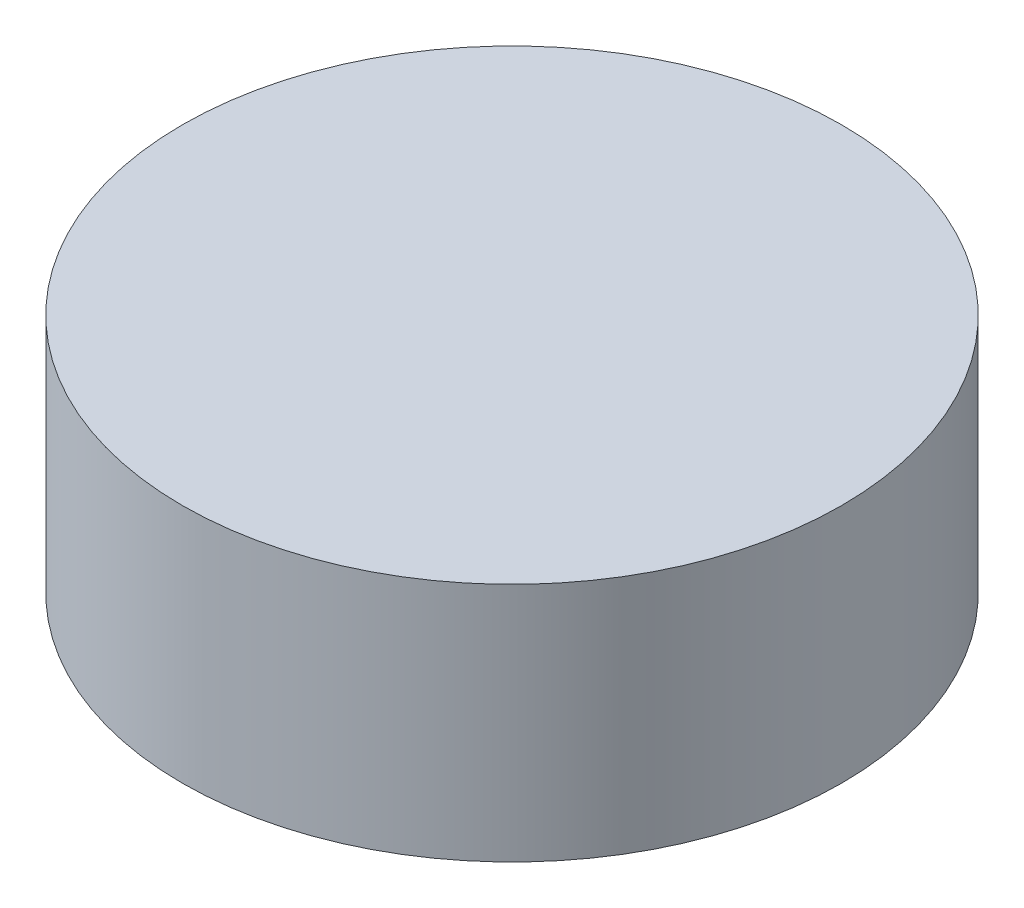
ISO-10303-21;
HEADER;
FILE_DESCRIPTION(('STEP AP214'),'2;1');
FILE_NAME('part.step','',(''),(''),'','','');
FILE_SCHEMA(('AUTOMOTIVE_DESIGN { 1 0 10303 214 1 1 1 1 }'));
ENDSEC;
DATA;
#1=APPLICATION_CONTEXT('core data for automotive mechanical design processes');
#2=APPLICATION_PROTOCOL_DEFINITION('international standard','automotive_design',2000,#1);
#3=PRODUCT_CONTEXT('',#1,'mechanical');
#4=PRODUCT('Part','Part','',(#3));
#5=PRODUCT_RELATED_PRODUCT_CATEGORY('part','',(#4));
#6=PRODUCT_DEFINITION_FORMATION('','',#4);
#7=PRODUCT_DEFINITION_CONTEXT('part definition',#1,'design');
#8=PRODUCT_DEFINITION('design','',#6,#7);
#9=PRODUCT_DEFINITION_SHAPE('','',#8);
#10=(LENGTH_UNIT() NAMED_UNIT(*) SI_UNIT(.MILLI.,.METRE.));
#11=(NAMED_UNIT(*) PLANE_ANGLE_UNIT() SI_UNIT($,.RADIAN.));
#12=(NAMED_UNIT(*) SI_UNIT($,.STERADIAN.) SOLID_ANGLE_UNIT());
#13=UNCERTAINTY_MEASURE_WITH_UNIT(LENGTH_MEASURE(1.E-05),#10,'distance_accuracy_value','');
#14=(GEOMETRIC_REPRESENTATION_CONTEXT(3) GLOBAL_UNCERTAINTY_ASSIGNED_CONTEXT((#13)) GLOBAL_UNIT_ASSIGNED_CONTEXT((#10,
#11,#12)) REPRESENTATION_CONTEXT('',''));
#15=CARTESIAN_POINT('',(0.,0.,0.));
#16=DIRECTION('',(0.,0.,1.));
#17=DIRECTION('',(1.,0.,0.));
#18=AXIS2_PLACEMENT_3D('',#15,#16,#17);
#19=CARTESIAN_POINT('',(0.,93.,0.));
#20=DIRECTION('',(0.,-1.,0.));
#21=DIRECTION('',(0.,0.,-1.));
#22=AXIS2_PLACEMENT_3D('',#19,#20,#21);
#23=CYLINDRICAL_SURFACE('',#22,127.5);
#24=CARTESIAN_POINT('',(0.,93.,0.));
#25=DIRECTION('',(0.,1.,0.));
#26=DIRECTION('',(0.,0.,1.));
#27=AXIS2_PLACEMENT_3D('',#24,#25,#26);
#28=CIRCLE('',#27,127.5);
#29=CARTESIAN_POINT('',(0.,93.,127.5));
#30=VERTEX_POINT('',#29);
#31=EDGE_CURVE('E10',#30,#30,#28,.T.);
#32=ORIENTED_EDGE('',*,*,#31,.F.);
#33=EDGE_LOOP('',(#32));
#34=FACE_BOUND('',#33,.T.);
#35=CARTESIAN_POINT('',(0.,0.,0.));
#36=DIRECTION('',(0.,1.,0.));
#37=DIRECTION('',(0.,0.,1.));
#38=AXIS2_PLACEMENT_3D('',#35,#36,#37);
#39=CIRCLE('',#38,127.5);
#40=CARTESIAN_POINT('',(0.,0.,127.5));
#41=VERTEX_POINT('',#40);
#42=EDGE_CURVE('E35',#41,#41,#39,.T.);
#43=ORIENTED_EDGE('',*,*,#42,.T.);
#44=EDGE_LOOP('',(#43));
#45=FACE_BOUND('',#44,.T.);
#46=ADVANCED_FACE('F29',(#34,#45),#23,.T.);
#47=CARTESIAN_POINT('',(0.,93.,0.));
#48=DIRECTION('',(0.,1.,0.));
#49=DIRECTION('',(0.,0.,1.));
#50=AXIS2_PLACEMENT_3D('',#47,#48,#49);
#51=PLANE('',#50);
#52=ORIENTED_EDGE('',*,*,#31,.T.);
#53=EDGE_LOOP('',(#52));
#54=FACE_BOUND('',#53,.T.);
#55=ADVANCED_FACE('F44',(#54),#51,.T.);
#56=CARTESIAN_POINT('',(0.,0.,0.));
#57=DIRECTION('',(0.,1.,0.));
#58=DIRECTION('',(0.,0.,1.));
#59=AXIS2_PLACEMENT_3D('',#56,#57,#58);
#60=PLANE('',#59);
#61=ORIENTED_EDGE('',*,*,#42,.F.);
#62=EDGE_LOOP('',(#61));
#63=FACE_BOUND('',#62,.T.);
#64=ADVANCED_FACE('F42',(#63),#60,.F.);
#65=CLOSED_SHELL('',(#46,#55,#64));
#66=MANIFOLD_SOLID_BREP('B2',#65);
#67=ADVANCED_BREP_SHAPE_REPRESENTATION('',(#18,#66),#14);
#68=SHAPE_DEFINITION_REPRESENTATION(#9,#67);
ENDSEC;
END-ISO-10303-21;
